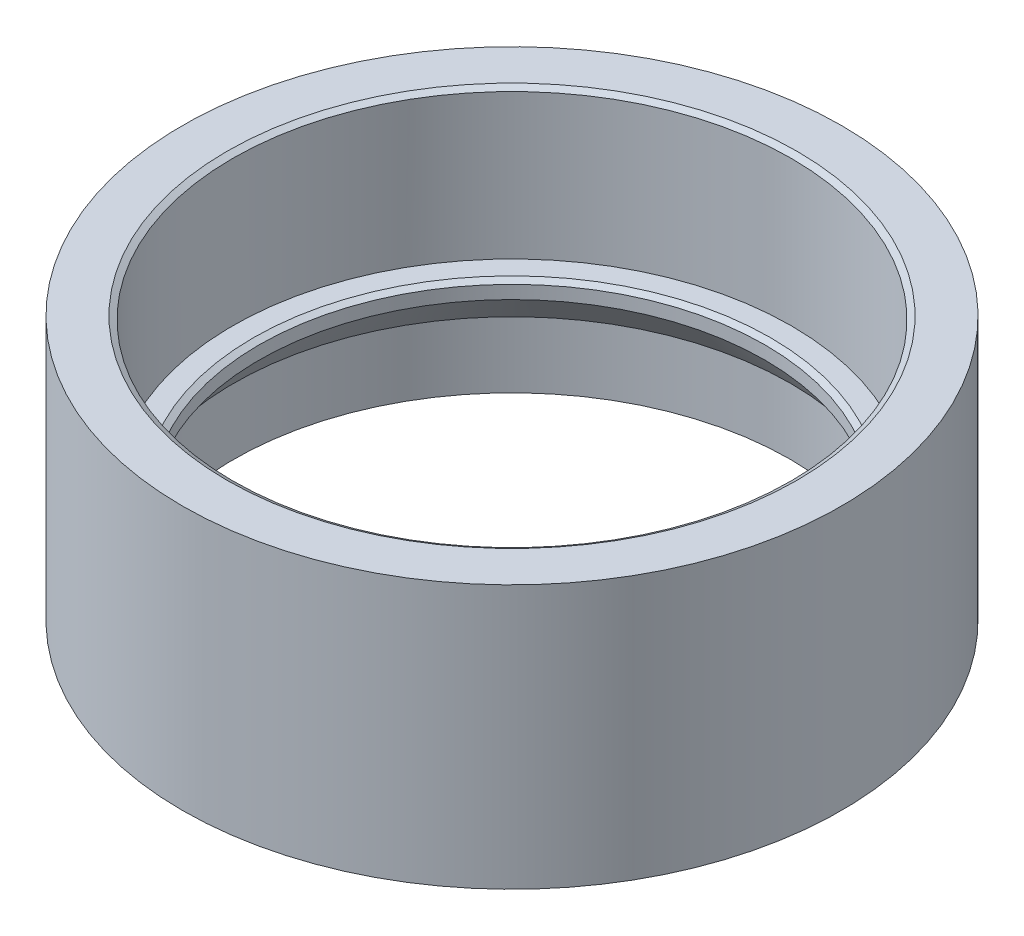
ISO-10303-21;
HEADER;
FILE_DESCRIPTION(('STEP AP214'),'2;1');
FILE_NAME('part.step','',(''),(''),'','','');
FILE_SCHEMA(('AUTOMOTIVE_DESIGN { 1 0 10303 214 1 1 1 1 }'));
ENDSEC;
DATA;
#1=APPLICATION_CONTEXT('core data for automotive mechanical design processes');
#2=APPLICATION_PROTOCOL_DEFINITION('international standard','automotive_design',2000,#1);
#3=PRODUCT_CONTEXT('',#1,'mechanical');
#4=PRODUCT('Part','Part','',(#3));
#5=PRODUCT_RELATED_PRODUCT_CATEGORY('part','',(#4));
#6=PRODUCT_DEFINITION_FORMATION('','',#4);
#7=PRODUCT_DEFINITION_CONTEXT('part definition',#1,'design');
#8=PRODUCT_DEFINITION('design','',#6,#7);
#9=PRODUCT_DEFINITION_SHAPE('','',#8);
#10=(LENGTH_UNIT() NAMED_UNIT(*) SI_UNIT(.MILLI.,.METRE.));
#11=(NAMED_UNIT(*) PLANE_ANGLE_UNIT() SI_UNIT($,.RADIAN.));
#12=(NAMED_UNIT(*) SI_UNIT($,.STERADIAN.) SOLID_ANGLE_UNIT());
#13=UNCERTAINTY_MEASURE_WITH_UNIT(LENGTH_MEASURE(1.E-05),#10,'distance_accuracy_value','');
#14=(GEOMETRIC_REPRESENTATION_CONTEXT(3) GLOBAL_UNCERTAINTY_ASSIGNED_CONTEXT((#13)) GLOBAL_UNIT_ASSIGNED_CONTEXT((#10,
#11,#12)) REPRESENTATION_CONTEXT('',''));
#15=CARTESIAN_POINT('',(0.,0.,0.));
#16=DIRECTION('',(0.,0.,1.));
#17=DIRECTION('',(1.,0.,0.));
#18=AXIS2_PLACEMENT_3D('',#15,#16,#17);
#19=CARTESIAN_POINT('',(89.9,0.,0.));
#20=DIRECTION('',(0.,-1.,0.));
#21=DIRECTION('',(0.,0.,-1.));
#22=AXIS2_PLACEMENT_3D('',#19,#20,#21);
#23=PLANE('',#22);
#24=CARTESIAN_POINT('',(0.,0.,0.));
#25=DIRECTION('',(0.,-1.,0.));
#26=DIRECTION('',(0.,0.,-1.));
#27=AXIS2_PLACEMENT_3D('',#24,#25,#26);
#28=CIRCLE('',#27,88.9);
#29=CARTESIAN_POINT('',(0.,0.,-88.9));
#30=VERTEX_POINT('',#29);
#31=EDGE_CURVE('E45',#30,#30,#28,.T.);
#32=ORIENTED_EDGE('',*,*,#31,.T.);
#33=EDGE_LOOP('',(#32));
#34=FACE_BOUND('',#33,.T.);
#35=CARTESIAN_POINT('',(0.,0.,0.));
#36=DIRECTION('',(0.,-1.,0.));
#37=DIRECTION('',(0.,0.,-1.));
#38=AXIS2_PLACEMENT_3D('',#35,#36,#37);
#39=CIRCLE('',#38,84.5);
#40=CARTESIAN_POINT('',(0.,0.,-84.5));
#41=VERTEX_POINT('',#40);
#42=EDGE_CURVE('E70',#41,#41,#39,.T.);
#43=ORIENTED_EDGE('',*,*,#42,.F.);
#44=EDGE_LOOP('',(#43));
#45=FACE_BOUND('',#44,.T.);
#46=ADVANCED_FACE('F38',(#34,#45),#23,.T.);
#47=CARTESIAN_POINT('',(0.,0.,0.));
#48=DIRECTION('',(0.,-1.,0.));
#49=DIRECTION('',(0.,0.,-1.));
#50=AXIS2_PLACEMENT_3D('',#47,#48,#49);
#51=CYLINDRICAL_SURFACE('',#50,84.5);
#52=ORIENTED_EDGE('',*,*,#42,.T.);
#53=EDGE_LOOP('',(#52));
#54=FACE_BOUND('',#53,.T.);
#55=CARTESIAN_POINT('',(0.,20.,0.));
#56=DIRECTION('',(0.,-1.,0.));
#57=DIRECTION('',(0.,0.,-1.));
#58=AXIS2_PLACEMENT_3D('',#55,#56,#57);
#59=CIRCLE('',#58,84.5);
#60=CARTESIAN_POINT('',(0.,20.,-84.5));
#61=VERTEX_POINT('',#60);
#62=EDGE_CURVE('E73',#61,#61,#59,.T.);
#63=ORIENTED_EDGE('',*,*,#62,.F.);
#64=EDGE_LOOP('',(#63));
#65=FACE_BOUND('',#64,.T.);
#66=ADVANCED_FACE('F114',(#54,#65),#51,.F.);
#67=CARTESIAN_POINT('',(0.,29.9984444867935,0.));
#68=DIRECTION('',(0.,-1.,0.));
#69=DIRECTION('',(0.,0.,-1.));
#70=AXIS2_PLACEMENT_3D('',#67,#68,#69);
#71=CONICAL_SURFACE('',#70,76.75,0.65938539140346);
#72=ORIENTED_EDGE('',*,*,#62,.T.);
#73=EDGE_LOOP('',(#72));
#74=FACE_BOUND('',#73,.T.);
#75=CARTESIAN_POINT('',(0.,29.9984444867935,0.));
#76=DIRECTION('',(0.,-1.,0.));
#77=DIRECTION('',(0.,0.,-1.));
#78=AXIS2_PLACEMENT_3D('',#75,#76,#77);
#79=CIRCLE('',#78,76.75);
#80=CARTESIAN_POINT('',(0.,29.9984444867935,-76.75));
#81=VERTEX_POINT('',#80);
#82=EDGE_CURVE('E76',#81,#81,#79,.T.);
#83=ORIENTED_EDGE('',*,*,#82,.F.);
#84=EDGE_LOOP('',(#83));
#85=FACE_BOUND('',#84,.T.);
#86=ADVANCED_FACE('F121',(#74,#85),#71,.F.);
#87=CARTESIAN_POINT('',(0.,0.,0.));
#88=DIRECTION('',(0.,-1.,0.));
#89=DIRECTION('',(0.,0.,-1.));
#90=AXIS2_PLACEMENT_3D('',#87,#88,#89);
#91=CYLINDRICAL_SURFACE('',#90,76.75);
#92=CARTESIAN_POINT('',(0.,33.9984444867934,0.));
#93=DIRECTION('',(0.,1.,0.));
#94=DIRECTION('',(0.,0.,1.));
#95=AXIS2_PLACEMENT_3D('',#92,#93,#94);
#96=CIRCLE('',#95,76.75);
#97=CARTESIAN_POINT('',(0.,33.9984444867934,76.75));
#98=VERTEX_POINT('',#97);
#99=EDGE_CURVE('E58',#98,#98,#96,.T.);
#100=ORIENTED_EDGE('',*,*,#99,.T.);
#101=EDGE_LOOP('',(#100));
#102=FACE_BOUND('',#101,.T.);
#103=ORIENTED_EDGE('',*,*,#82,.T.);
#104=EDGE_LOOP('',(#103));
#105=FACE_BOUND('',#104,.T.);
#106=ADVANCED_FACE('F173',(#102,#105),#91,.F.);
#107=CARTESIAN_POINT('',(76.75,34.9984444867935,0.));
#108=DIRECTION('',(0.,1.,0.));
#109=DIRECTION('',(0.,0.,1.));
#110=AXIS2_PLACEMENT_3D('',#107,#108,#109);
#111=PLANE('',#110);
#112=CARTESIAN_POINT('',(0.,34.9984444867935,0.));
#113=DIRECTION('',(0.,1.,0.));
#114=DIRECTION('',(0.,0.,1.));
#115=AXIS2_PLACEMENT_3D('',#112,#113,#114);
#116=CIRCLE('',#115,78.4820508075688);
#117=CARTESIAN_POINT('',(0.,34.9984444867935,78.4820508075688));
#118=VERTEX_POINT('',#117);
#119=EDGE_CURVE('E61',#118,#118,#116,.F.);
#120=ORIENTED_EDGE('',*,*,#119,.T.);
#121=EDGE_LOOP('',(#120));
#122=FACE_BOUND('',#121,.T.);
#123=CARTESIAN_POINT('',(0.,34.9984444867935,0.));
#124=DIRECTION('',(0.,-1.,0.));
#125=DIRECTION('',(0.,0.,-1.));
#126=AXIS2_PLACEMENT_3D('',#123,#124,#125);
#127=CIRCLE('',#126,84.75);
#128=CARTESIAN_POINT('',(0.,34.9984444867935,-84.75));
#129=VERTEX_POINT('',#128);
#130=EDGE_CURVE('E79',#129,#129,#127,.T.);
#131=ORIENTED_EDGE('',*,*,#130,.F.);
#132=EDGE_LOOP('',(#131));
#133=FACE_BOUND('',#132,.T.);
#134=ADVANCED_FACE('F169',(#122,#133),#111,.T.);
#135=CARTESIAN_POINT('',(0.,0.,0.));
#136=DIRECTION('',(0.,-1.,0.));
#137=DIRECTION('',(0.,0.,-1.));
#138=AXIS2_PLACEMENT_3D('',#135,#136,#137);
#139=CYLINDRICAL_SURFACE('',#138,84.75);
#140=CARTESIAN_POINT('',(0.,79.,0.));
#141=DIRECTION('',(0.,1.,0.));
#142=DIRECTION('',(0.,0.,1.));
#143=AXIS2_PLACEMENT_3D('',#140,#141,#142);
#144=CIRCLE('',#143,84.75);
#145=CARTESIAN_POINT('',(0.,79.,84.75));
#146=VERTEX_POINT('',#145);
#147=EDGE_CURVE('E64',#146,#146,#144,.T.);
#148=ORIENTED_EDGE('',*,*,#147,.T.);
#149=EDGE_LOOP('',(#148));
#150=FACE_BOUND('',#149,.T.);
#151=ORIENTED_EDGE('',*,*,#130,.T.);
#152=EDGE_LOOP('',(#151));
#153=FACE_BOUND('',#152,.T.);
#154=ADVANCED_FACE('F163',(#150,#153),#139,.F.);
#155=CARTESIAN_POINT('',(84.75,80.,0.));
#156=DIRECTION('',(0.,1.,0.));
#157=DIRECTION('',(0.,0.,1.));
#158=AXIS2_PLACEMENT_3D('',#155,#156,#157);
#159=PLANE('',#158);
#160=CARTESIAN_POINT('',(0.,80.,0.));
#161=DIRECTION('',(0.,1.,0.));
#162=DIRECTION('',(0.,0.,1.));
#163=AXIS2_PLACEMENT_3D('',#160,#161,#162);
#164=CIRCLE('',#163,86.4820508075689);
#165=CARTESIAN_POINT('',(0.,80.,86.4820508075689));
#166=VERTEX_POINT('',#165);
#167=EDGE_CURVE('E67',#166,#166,#164,.F.);
#168=ORIENTED_EDGE('',*,*,#167,.T.);
#169=EDGE_LOOP('',(#168));
#170=FACE_BOUND('',#169,.T.);
#171=CARTESIAN_POINT('',(0.,80.,0.));
#172=DIRECTION('',(0.,-1.,0.));
#173=DIRECTION('',(0.,0.,-1.));
#174=AXIS2_PLACEMENT_3D('',#171,#172,#173);
#175=CIRCLE('',#174,100.);
#176=CARTESIAN_POINT('',(0.,80.,-100.));
#177=VERTEX_POINT('',#176);
#178=EDGE_CURVE('E82',#177,#177,#175,.T.);
#179=ORIENTED_EDGE('',*,*,#178,.F.);
#180=EDGE_LOOP('',(#179));
#181=FACE_BOUND('',#180,.T.);
#182=ADVANCED_FACE('F156',(#170,#181),#159,.T.);
#183=CARTESIAN_POINT('',(0.,0.,0.));
#184=DIRECTION('',(0.,-1.,0.));
#185=DIRECTION('',(0.,0.,-1.));
#186=AXIS2_PLACEMENT_3D('',#183,#184,#185);
#187=CYLINDRICAL_SURFACE('',#186,100.);
#188=ORIENTED_EDGE('',*,*,#178,.T.);
#189=EDGE_LOOP('',(#188));
#190=FACE_BOUND('',#189,.T.);
#191=CARTESIAN_POINT('',(0.,0.,0.));
#192=DIRECTION('',(0.,-1.,0.));
#193=DIRECTION('',(0.,0.,-1.));
#194=AXIS2_PLACEMENT_3D('',#191,#192,#193);
#195=CIRCLE('',#194,100.);
#196=CARTESIAN_POINT('',(0.,0.,-100.));
#197=VERTEX_POINT('',#196);
#198=EDGE_CURVE('E85',#197,#197,#195,.T.);
#199=ORIENTED_EDGE('',*,*,#198,.F.);
#200=EDGE_LOOP('',(#199));
#201=FACE_BOUND('',#200,.T.);
#202=ADVANCED_FACE('F152',(#190,#201),#187,.T.);
#203=CARTESIAN_POINT('',(100.,0.,0.));
#204=DIRECTION('',(0.,-1.,0.));
#205=DIRECTION('',(0.,0.,-1.));
#206=AXIS2_PLACEMENT_3D('',#203,#204,#205);
#207=PLANE('',#206);
#208=CARTESIAN_POINT('',(0.,0.,0.));
#209=DIRECTION('',(0.,-1.,0.));
#210=DIRECTION('',(0.,0.,-1.));
#211=AXIS2_PLACEMENT_3D('',#208,#209,#210);
#212=CIRCLE('',#211,96.);
#213=CARTESIAN_POINT('',(0.,0.,-96.));
#214=VERTEX_POINT('',#213);
#215=EDGE_CURVE('E49',#214,#214,#212,.F.);
#216=ORIENTED_EDGE('',*,*,#215,.T.);
#217=EDGE_LOOP('',(#216));
#218=FACE_BOUND('',#217,.T.);
#219=ORIENTED_EDGE('',*,*,#198,.T.);
#220=EDGE_LOOP('',(#219));
#221=FACE_BOUND('',#220,.T.);
#222=ADVANCED_FACE('F110',(#218,#221),#207,.T.);
#223=CARTESIAN_POINT('',(0.,0.,0.));
#224=DIRECTION('',(0.,-1.,0.));
#225=DIRECTION('',(0.,0.,-1.));
#226=AXIS2_PLACEMENT_3D('',#223,#224,#225);
#227=CYLINDRICAL_SURFACE('',#226,95.);
#228=CARTESIAN_POINT('',(0.,1.,0.));
#229=DIRECTION('',(0.,-1.,0.));
#230=DIRECTION('',(0.,0.,-1.));
#231=AXIS2_PLACEMENT_3D('',#228,#229,#230);
#232=CIRCLE('',#231,95.);
#233=CARTESIAN_POINT('',(0.,1.,-95.));
#234=VERTEX_POINT('',#233);
#235=EDGE_CURVE('E53',#234,#234,#232,.T.);
#236=ORIENTED_EDGE('',*,*,#235,.T.);
#237=EDGE_LOOP('',(#236));
#238=FACE_BOUND('',#237,.T.);
#239=CARTESIAN_POINT('',(0.,5.,0.));
#240=DIRECTION('',(0.,-1.,0.));
#241=DIRECTION('',(0.,0.,-1.));
#242=AXIS2_PLACEMENT_3D('',#239,#240,#241);
#243=CIRCLE('',#242,95.);
#244=CARTESIAN_POINT('',(0.,5.,-95.));
#245=VERTEX_POINT('',#244);
#246=EDGE_CURVE('E88',#245,#245,#243,.T.);
#247=ORIENTED_EDGE('',*,*,#246,.F.);
#248=EDGE_LOOP('',(#247));
#249=FACE_BOUND('',#248,.T.);
#250=ADVANCED_FACE('F99',(#238,#249),#227,.F.);
#251=CARTESIAN_POINT('',(89.9,5.,0.));
#252=DIRECTION('',(0.,-1.,0.));
#253=DIRECTION('',(0.,0.,-1.));
#254=AXIS2_PLACEMENT_3D('',#251,#252,#253);
#255=PLANE('',#254);
#256=ORIENTED_EDGE('',*,*,#246,.T.);
#257=EDGE_LOOP('',(#256));
#258=FACE_BOUND('',#257,.T.);
#259=CARTESIAN_POINT('',(0.,5.,0.));
#260=DIRECTION('',(0.,-1.,0.));
#261=DIRECTION('',(0.,0.,-1.));
#262=AXIS2_PLACEMENT_3D('',#259,#260,#261);
#263=CIRCLE('',#262,89.9);
#264=CARTESIAN_POINT('',(0.,5.,-89.9));
#265=VERTEX_POINT('',#264);
#266=EDGE_CURVE('E91',#265,#265,#263,.T.);
#267=ORIENTED_EDGE('',*,*,#266,.F.);
#268=EDGE_LOOP('',(#267));
#269=FACE_BOUND('',#268,.T.);
#270=ADVANCED_FACE('F97',(#258,#269),#255,.T.);
#271=CARTESIAN_POINT('',(0.,0.,0.));
#272=DIRECTION('',(0.,-1.,0.));
#273=DIRECTION('',(0.,0.,-1.));
#274=AXIS2_PLACEMENT_3D('',#271,#272,#273);
#275=CYLINDRICAL_SURFACE('',#274,89.9);
#276=CARTESIAN_POINT('',(0.,1.,0.));
#277=DIRECTION('',(0.,-1.,0.));
#278=DIRECTION('',(0.,0.,-1.));
#279=AXIS2_PLACEMENT_3D('',#276,#277,#278);
#280=CIRCLE('',#279,89.9);
#281=CARTESIAN_POINT('',(0.,1.,-89.9));
#282=VERTEX_POINT('',#281);
#283=EDGE_CURVE('E10',#282,#282,#280,.F.);
#284=ORIENTED_EDGE('',*,*,#283,.T.);
#285=EDGE_LOOP('',(#284));
#286=FACE_BOUND('',#285,.T.);
#287=ORIENTED_EDGE('',*,*,#266,.T.);
#288=EDGE_LOOP('',(#287));
#289=FACE_BOUND('',#288,.T.);
#290=ADVANCED_FACE('F95',(#286,#289),#275,.T.);
#291=CARTESIAN_POINT('',(0.,80.,0.));
#292=DIRECTION('',(0.,1.,0.));
#293=DIRECTION('',(0.,0.,1.));
#294=AXIS2_PLACEMENT_3D('',#291,#292,#293);
#295=CONICAL_SURFACE('',#294,86.4820508075689,1.04719755119659);
#296=ORIENTED_EDGE('',*,*,#147,.F.);
#297=EDGE_LOOP('',(#296));
#298=FACE_BOUND('',#297,.T.);
#299=ORIENTED_EDGE('',*,*,#167,.F.);
#300=EDGE_LOOP('',(#299));
#301=FACE_BOUND('',#300,.T.);
#302=ADVANCED_FACE('F107',(#298,#301),#295,.F.);
#303=CARTESIAN_POINT('',(0.,34.9984444867935,0.));
#304=DIRECTION('',(0.,1.,0.));
#305=DIRECTION('',(0.,0.,1.));
#306=AXIS2_PLACEMENT_3D('',#303,#304,#305);
#307=CONICAL_SURFACE('',#306,78.4820508075688,1.04719755119659);
#308=ORIENTED_EDGE('',*,*,#99,.F.);
#309=EDGE_LOOP('',(#308));
#310=FACE_BOUND('',#309,.T.);
#311=ORIENTED_EDGE('',*,*,#119,.F.);
#312=EDGE_LOOP('',(#311));
#313=FACE_BOUND('',#312,.T.);
#314=ADVANCED_FACE('F133',(#310,#313),#307,.F.);
#315=CARTESIAN_POINT('',(0.,1.,0.));
#316=DIRECTION('',(0.,-1.,0.));
#317=DIRECTION('',(0.,0.,-1.));
#318=AXIS2_PLACEMENT_3D('',#315,#316,#317);
#319=TOROIDAL_SURFACE('',#318,96.,1.);
#320=ORIENTED_EDGE('',*,*,#215,.F.);
#321=EDGE_LOOP('',(#320));
#322=FACE_BOUND('',#321,.T.);
#323=ORIENTED_EDGE('',*,*,#235,.F.);
#324=EDGE_LOOP('',(#323));
#325=FACE_BOUND('',#324,.T.);
#326=ADVANCED_FACE('F137',(#322,#325),#319,.T.);
#327=CARTESIAN_POINT('',(0.,1.,0.));
#328=DIRECTION('',(0.,-1.,0.));
#329=DIRECTION('',(0.,0.,-1.));
#330=AXIS2_PLACEMENT_3D('',#327,#328,#329);
#331=TOROIDAL_SURFACE('',#330,88.9,1.);
#332=ORIENTED_EDGE('',*,*,#283,.F.);
#333=EDGE_LOOP('',(#332));
#334=FACE_BOUND('',#333,.T.);
#335=ORIENTED_EDGE('',*,*,#31,.F.);
#336=EDGE_LOOP('',(#335));
#337=FACE_BOUND('',#336,.T.);
#338=ADVANCED_FACE('F40',(#334,#337),#331,.T.);
#339=CLOSED_SHELL('',(#46,#66,#86,#106,#134,#154,#182,#202,#222,#250,#270,#290,#302,#314,#326,#338));
#340=MANIFOLD_SOLID_BREP('B2',#339);
#341=ADVANCED_BREP_SHAPE_REPRESENTATION('',(#18,#340),#14);
#342=SHAPE_DEFINITION_REPRESENTATION(#9,#341);
ENDSEC;
END-ISO-10303-21;
